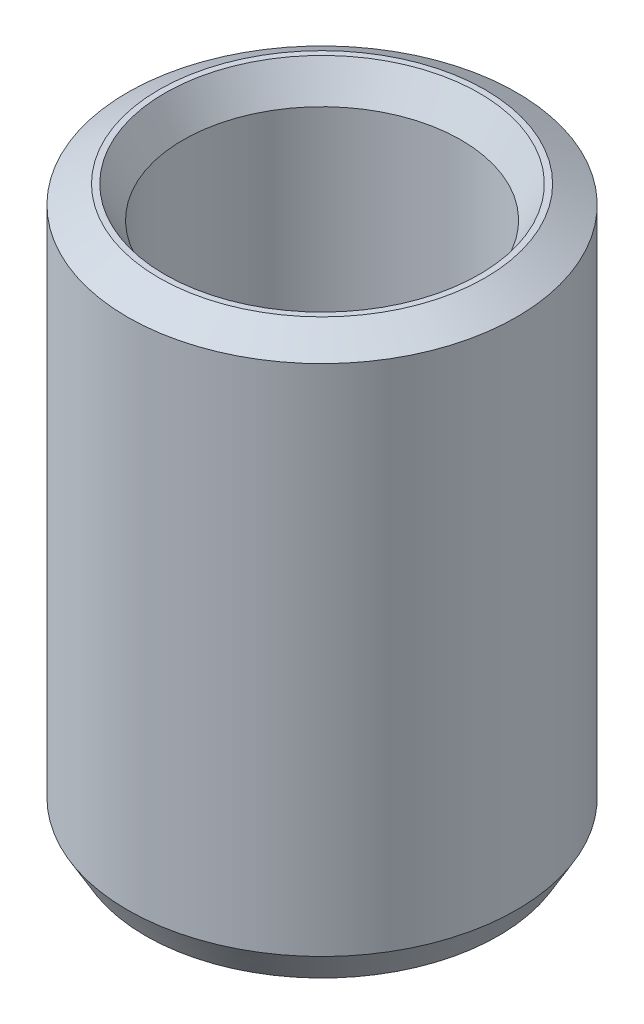
ISO-10303-21;
HEADER;
FILE_DESCRIPTION(('STEP AP214'),'2;1');
FILE_NAME('part.step','',(''),(''),'','','');
FILE_SCHEMA(('AUTOMOTIVE_DESIGN { 1 0 10303 214 1 1 1 1 }'));
ENDSEC;
DATA;
#1=APPLICATION_CONTEXT('core data for automotive mechanical design processes');
#2=APPLICATION_PROTOCOL_DEFINITION('international standard','automotive_design',2000,#1);
#3=PRODUCT_CONTEXT('',#1,'mechanical');
#4=PRODUCT('Part','Part','',(#3));
#5=PRODUCT_RELATED_PRODUCT_CATEGORY('part','',(#4));
#6=PRODUCT_DEFINITION_FORMATION('','',#4);
#7=PRODUCT_DEFINITION_CONTEXT('part definition',#1,'design');
#8=PRODUCT_DEFINITION('design','',#6,#7);
#9=PRODUCT_DEFINITION_SHAPE('','',#8);
#10=(LENGTH_UNIT() NAMED_UNIT(*) SI_UNIT(.MILLI.,.METRE.));
#11=(NAMED_UNIT(*) PLANE_ANGLE_UNIT() SI_UNIT($,.RADIAN.));
#12=(NAMED_UNIT(*) SI_UNIT($,.STERADIAN.) SOLID_ANGLE_UNIT());
#13=UNCERTAINTY_MEASURE_WITH_UNIT(LENGTH_MEASURE(1.E-05),#10,'distance_accuracy_value','');
#14=(GEOMETRIC_REPRESENTATION_CONTEXT(3) GLOBAL_UNCERTAINTY_ASSIGNED_CONTEXT((#13)) GLOBAL_UNIT_ASSIGNED_CONTEXT((#10,
#11,#12)) REPRESENTATION_CONTEXT('',''));
#15=CARTESIAN_POINT('',(0.,0.,0.));
#16=DIRECTION('',(0.,0.,1.));
#17=DIRECTION('',(1.,0.,0.));
#18=AXIS2_PLACEMENT_3D('',#15,#16,#17);
#19=CARTESIAN_POINT('',(0.,65.1270841142895,0.));
#20=DIRECTION('',(0.,-1.,0.));
#21=DIRECTION('',(0.,0.,-1.));
#22=AXIS2_PLACEMENT_3D('',#19,#20,#21);
#23=CYLINDRICAL_SURFACE('',#22,22.5);
#24=CARTESIAN_POINT('',(0.,3.64541651991385,0.));
#25=DIRECTION('',(0.,1.,0.));
#26=DIRECTION('',(0.,0.,1.));
#27=AXIS2_PLACEMENT_3D('',#24,#25,#26);
#28=CIRCLE('',#27,22.5);
#29=CARTESIAN_POINT('',(0.,3.64541651991385,22.5));
#30=VERTEX_POINT('',#29);
#31=EDGE_CURVE('E10',#30,#30,#28,.T.);
#32=ORIENTED_EDGE('',*,*,#31,.T.);
#33=EDGE_LOOP('',(#32));
#34=FACE_BOUND('',#33,.T.);
#35=CARTESIAN_POINT('',(0.,63.0224019052089,0.));
#36=DIRECTION('',(0.,1.,0.));
#37=DIRECTION('',(0.,0.,1.));
#38=AXIS2_PLACEMENT_3D('',#35,#36,#37);
#39=CIRCLE('',#38,22.5);
#40=CARTESIAN_POINT('',(0.,63.0224019052089,22.5));
#41=VERTEX_POINT('',#40);
#42=EDGE_CURVE('E50',#41,#41,#39,.F.);
#43=ORIENTED_EDGE('',*,*,#42,.T.);
#44=EDGE_LOOP('',(#43));
#45=FACE_BOUND('',#44,.T.);
#46=ADVANCED_FACE('F39',(#34,#45),#23,.T.);
#47=CARTESIAN_POINT('',(0.,65.1270841142895,0.));
#48=DIRECTION('',(0.,1.,0.));
#49=DIRECTION('',(0.,0.,1.));
#50=AXIS2_PLACEMENT_3D('',#47,#48,#49);
#51=PLANE('',#50);
#52=CARTESIAN_POINT('',(0.,65.1270841142895,0.));
#53=DIRECTION('',(0.,1.,0.));
#54=DIRECTION('',(0.,0.,1.));
#55=AXIS2_PLACEMENT_3D('',#52,#53,#54);
#56=CIRCLE('',#55,18.1791557783635);
#57=CARTESIAN_POINT('',(0.,65.1270841142895,18.1791557783635));
#58=VERTEX_POINT('',#57);
#59=EDGE_CURVE('E58',#58,#58,#56,.F.);
#60=ORIENTED_EDGE('',*,*,#59,.T.);
#61=EDGE_LOOP('',(#60));
#62=FACE_BOUND('',#61,.T.);
#63=CARTESIAN_POINT('',(0.,65.1270841142895,0.));
#64=DIRECTION('',(0.,1.,0.));
#65=DIRECTION('',(0.,0.,1.));
#66=AXIS2_PLACEMENT_3D('',#63,#64,#65);
#67=CIRCLE('',#66,18.8545834800861);
#68=CARTESIAN_POINT('',(0.,65.1270841142895,18.8545834800861));
#69=VERTEX_POINT('',#68);
#70=EDGE_CURVE('E61',#69,#69,#67,.T.);
#71=ORIENTED_EDGE('',*,*,#70,.T.);
#72=EDGE_LOOP('',(#71));
#73=FACE_BOUND('',#72,.T.);
#74=ADVANCED_FACE('F88',(#62,#73),#51,.T.);
#75=CARTESIAN_POINT('',(0.,0.,0.));
#76=DIRECTION('',(0.,1.,0.));
#77=DIRECTION('',(0.,0.,1.));
#78=AXIS2_PLACEMENT_3D('',#75,#76,#77);
#79=PLANE('',#78);
#80=CARTESIAN_POINT('',(0.,0.,0.));
#81=DIRECTION('',(0.,1.,0.));
#82=DIRECTION('',(0.,0.,1.));
#83=AXIS2_PLACEMENT_3D('',#80,#81,#82);
#84=CIRCLE('',#83,19.7198900891968);
#85=CARTESIAN_POINT('',(0.,0.,19.7198900891968));
#86=VERTEX_POINT('',#85);
#87=EDGE_CURVE('E51',#86,#86,#84,.T.);
#88=ORIENTED_EDGE('',*,*,#87,.T.);
#89=EDGE_LOOP('',(#88));
#90=FACE_BOUND('',#89,.T.);
#91=CARTESIAN_POINT('',(0.,0.,0.));
#92=DIRECTION('',(0.,1.,0.));
#93=DIRECTION('',(0.,0.,1.));
#94=AXIS2_PLACEMENT_3D('',#91,#92,#93);
#95=CIRCLE('',#94,20.3953177909194);
#96=CARTESIAN_POINT('',(0.,0.,20.3953177909194));
#97=VERTEX_POINT('',#96);
#98=EDGE_CURVE('E54',#97,#97,#95,.F.);
#99=ORIENTED_EDGE('',*,*,#98,.T.);
#100=EDGE_LOOP('',(#99));
#101=FACE_BOUND('',#100,.T.);
#102=ADVANCED_FACE('F83',(#90,#101),#79,.F.);
#103=CARTESIAN_POINT('',(0.,65.1270841142895,0.));
#104=DIRECTION('',(0.,-1.,0.));
#105=DIRECTION('',(0.,0.,-1.));
#106=AXIS2_PLACEMENT_3D('',#103,#104,#105);
#107=CYLINDRICAL_SURFACE('',#106,16.0744735692829);
#108=CARTESIAN_POINT('',(0.,61.4816675943756,0.));
#109=DIRECTION('',(0.,1.,0.));
#110=DIRECTION('',(0.,0.,1.));
#111=AXIS2_PLACEMENT_3D('',#108,#109,#110);
#112=CIRCLE('',#111,16.0744735692829);
#113=CARTESIAN_POINT('',(0.,61.4816675943756,16.0744735692829));
#114=VERTEX_POINT('',#113);
#115=EDGE_CURVE('E67',#114,#114,#112,.T.);
#116=ORIENTED_EDGE('',*,*,#115,.T.);
#117=EDGE_LOOP('',(#116));
#118=FACE_BOUND('',#117,.T.);
#119=CARTESIAN_POINT('',(0.,2.10468220908058,0.));
#120=DIRECTION('',(0.,1.,0.));
#121=DIRECTION('',(0.,0.,1.));
#122=AXIS2_PLACEMENT_3D('',#119,#120,#121);
#123=CIRCLE('',#122,16.0744735692829);
#124=CARTESIAN_POINT('',(0.,2.10468220908058,16.0744735692829));
#125=VERTEX_POINT('',#124);
#126=EDGE_CURVE('E69',#125,#125,#123,.F.);
#127=ORIENTED_EDGE('',*,*,#126,.T.);
#128=EDGE_LOOP('',(#127));
#129=FACE_BOUND('',#128,.T.);
#130=ADVANCED_FACE('F71',(#118,#129),#107,.F.);
#131=CARTESIAN_POINT('',(0.,61.4816675943756,0.));
#132=DIRECTION('',(0.,1.,0.));
#133=DIRECTION('',(0.,0.,1.));
#134=AXIS2_PLACEMENT_3D('',#131,#132,#133);
#135=CONICAL_SURFACE('',#134,16.0744735692829,0.523598775598305);
#136=ORIENTED_EDGE('',*,*,#59,.F.);
#137=EDGE_LOOP('',(#136));
#138=FACE_BOUND('',#137,.T.);
#139=ORIENTED_EDGE('',*,*,#115,.F.);
#140=EDGE_LOOP('',(#139));
#141=FACE_BOUND('',#140,.T.);
#142=ADVANCED_FACE('F77',(#138,#141),#135,.F.);
#143=CARTESIAN_POINT('',(0.,0.,0.));
#144=DIRECTION('',(0.,-1.,0.));
#145=DIRECTION('',(0.,0.,-1.));
#146=AXIS2_PLACEMENT_3D('',#143,#144,#145);
#147=CONICAL_SURFACE('',#146,19.7198900891968,1.04719755119659);
#148=ORIENTED_EDGE('',*,*,#126,.F.);
#149=EDGE_LOOP('',(#148));
#150=FACE_BOUND('',#149,.T.);
#151=ORIENTED_EDGE('',*,*,#87,.F.);
#152=EDGE_LOOP('',(#151));
#153=FACE_BOUND('',#152,.T.);
#154=ADVANCED_FACE('F73',(#150,#153),#147,.F.);
#155=CARTESIAN_POINT('',(0.,3.64541651991385,0.));
#156=DIRECTION('',(0.,1.,0.));
#157=DIRECTION('',(0.,0.,1.));
#158=AXIS2_PLACEMENT_3D('',#155,#156,#157);
#159=CONICAL_SURFACE('',#158,22.5,0.523598775598304);
#160=ORIENTED_EDGE('',*,*,#98,.F.);
#161=EDGE_LOOP('',(#160));
#162=FACE_BOUND('',#161,.T.);
#163=ORIENTED_EDGE('',*,*,#31,.F.);
#164=EDGE_LOOP('',(#163));
#165=FACE_BOUND('',#164,.T.);
#166=ADVANCED_FACE('F76',(#162,#165),#159,.T.);
#167=CARTESIAN_POINT('',(0.,65.1270841142895,0.));
#168=DIRECTION('',(0.,-1.,0.));
#169=DIRECTION('',(0.,0.,-1.));
#170=AXIS2_PLACEMENT_3D('',#167,#168,#169);
#171=CONICAL_SURFACE('',#170,18.8545834800861,1.0471975511966);
#172=ORIENTED_EDGE('',*,*,#42,.F.);
#173=EDGE_LOOP('',(#172));
#174=FACE_BOUND('',#173,.T.);
#175=ORIENTED_EDGE('',*,*,#70,.F.);
#176=EDGE_LOOP('',(#175));
#177=FACE_BOUND('',#176,.T.);
#178=ADVANCED_FACE('F45',(#174,#177),#171,.T.);
#179=CLOSED_SHELL('',(#46,#74,#102,#130,#142,#154,#166,#178));
#180=MANIFOLD_SOLID_BREP('B2',#179);
#181=ADVANCED_BREP_SHAPE_REPRESENTATION('',(#18,#180),#14);
#182=SHAPE_DEFINITION_REPRESENTATION(#9,#181);
ENDSEC;
END-ISO-10303-21;
